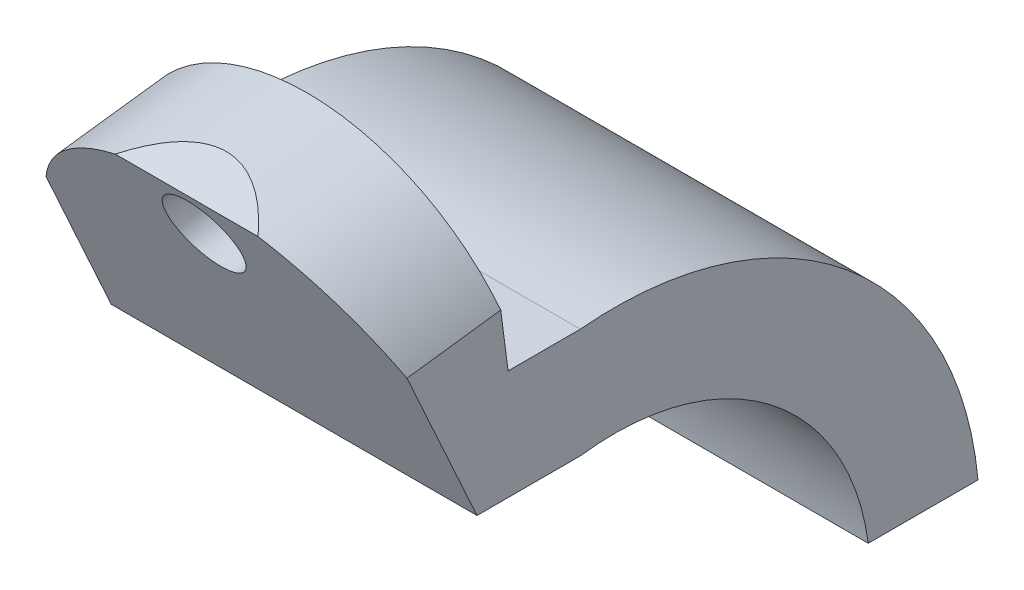
ISO-10303-21;
HEADER;
FILE_DESCRIPTION(('STEP AP214'),'2;1');
FILE_NAME('part.step','',(''),(''),'','','');
FILE_SCHEMA(('AUTOMOTIVE_DESIGN { 1 0 10303 214 1 1 1 1 }'));
ENDSEC;
DATA;
#1=APPLICATION_CONTEXT('core data for automotive mechanical design processes');
#2=APPLICATION_PROTOCOL_DEFINITION('international standard','automotive_design',2000,#1);
#3=PRODUCT_CONTEXT('',#1,'mechanical');
#4=PRODUCT('Part','Part','',(#3));
#5=PRODUCT_RELATED_PRODUCT_CATEGORY('part','',(#4));
#6=PRODUCT_DEFINITION_FORMATION('','',#4);
#7=PRODUCT_DEFINITION_CONTEXT('part definition',#1,'design');
#8=PRODUCT_DEFINITION('design','',#6,#7);
#9=PRODUCT_DEFINITION_SHAPE('','',#8);
#10=(LENGTH_UNIT() NAMED_UNIT(*) SI_UNIT(.MILLI.,.METRE.));
#11=(NAMED_UNIT(*) PLANE_ANGLE_UNIT() SI_UNIT($,.RADIAN.));
#12=(NAMED_UNIT(*) SI_UNIT($,.STERADIAN.) SOLID_ANGLE_UNIT());
#13=UNCERTAINTY_MEASURE_WITH_UNIT(LENGTH_MEASURE(1.E-05),#10,'distance_accuracy_value','');
#14=(GEOMETRIC_REPRESENTATION_CONTEXT(3) GLOBAL_UNCERTAINTY_ASSIGNED_CONTEXT((#13)) GLOBAL_UNIT_ASSIGNED_CONTEXT((#10,
#11,#12)) REPRESENTATION_CONTEXT('',''));
#15=CARTESIAN_POINT('',(0.,0.,0.));
#16=DIRECTION('',(0.,0.,1.));
#17=DIRECTION('',(1.,0.,0.));
#18=AXIS2_PLACEMENT_3D('',#15,#16,#17);
#19=CARTESIAN_POINT('',(100.,-29.7975521547871,69.3759802077101));
#20=DIRECTION('',(-1.,0.,0.));
#21=DIRECTION('',(0.,0.,1.));
#22=AXIS2_PLACEMENT_3D('',#19,#20,#21);
#23=CYLINDRICAL_SURFACE('',#22,70.);
#24=CARTESIAN_POINT('',(0.,-29.7975521547871,69.3759802077101));
#25=DIRECTION('',(-1.,0.,0.));
#26=DIRECTION('',(0.,0.,-1.));
#27=AXIS2_PLACEMENT_3D('',#24,#25,#26);
#28=CIRCLE('',#27,70.);
#29=CARTESIAN_POINT('',(0.,39.578428052923,78.7019316454676));
#30=VERTEX_POINT('',#29);
#31=CARTESIAN_POINT('',(0.,-20.4716007170291,0.));
#32=VERTEX_POINT('',#31);
#33=EDGE_CURVE('E225',#30,#32,#28,.T.);
#34=ORIENTED_EDGE('',*,*,#33,.T.);
#35=DIRECTION('',(-1.,0.,0.));
#36=VECTOR('',#35,1.);
#37=CARTESIAN_POINT('',(100.,-20.4716007170291,0.));
#38=LINE('',#37,#36);
#39=CARTESIAN_POINT('',(100.,-20.4716007170291,0.));
#40=VERTEX_POINT('',#39);
#41=EDGE_CURVE('E229',#40,#32,#38,.T.);
#42=ORIENTED_EDGE('',*,*,#41,.F.);
#43=CARTESIAN_POINT('',(100.,-29.7975521547871,69.3759802077101));
#44=DIRECTION('',(-1.,0.,0.));
#45=DIRECTION('',(0.,0.,-1.));
#46=AXIS2_PLACEMENT_3D('',#43,#44,#45);
#47=CIRCLE('',#46,70.);
#48=CARTESIAN_POINT('',(100.,39.578428052923,78.7019316454676));
#49=VERTEX_POINT('',#48);
#50=EDGE_CURVE('E127',#49,#40,#47,.T.);
#51=ORIENTED_EDGE('',*,*,#50,.F.);
#52=DIRECTION('',(-1.,0.,0.));
#53=VECTOR('',#52,1.);
#54=CARTESIAN_POINT('',(100.,39.578428052923,78.7019316454676));
#55=LINE('',#54,#53);
#56=EDGE_CURVE('E144',#49,#30,#55,.T.);
#57=ORIENTED_EDGE('',*,*,#56,.T.);
#58=EDGE_LOOP('',(#34,#42,#51,#57));
#59=FACE_BOUND('',#58,.T.);
#60=ADVANCED_FACE('F102',(#59),#23,.F.);
#61=CARTESIAN_POINT('',(100.,-20.4716007170291,0.));
#62=DIRECTION('',(0.,1.,0.));
#63=DIRECTION('',(0.,0.,1.));
#64=AXIS2_PLACEMENT_3D('',#61,#62,#63);
#65=PLANE('',#64);
#66=DIRECTION('',(0.,0.,-1.));
#67=VECTOR('',#66,1.);
#68=CARTESIAN_POINT('',(0.,-20.4716007170291,0.));
#69=LINE('',#68,#67);
#70=CARTESIAN_POINT('',(0.,-20.4716007170291,-30.));
#71=VERTEX_POINT('',#70);
#72=EDGE_CURVE('E222',#32,#71,#69,.T.);
#73=ORIENTED_EDGE('',*,*,#72,.T.);
#74=DIRECTION('',(-1.,0.,0.));
#75=VECTOR('',#74,1.);
#76=CARTESIAN_POINT('',(100.,-20.4716007170291,-30.));
#77=LINE('',#76,#75);
#78=CARTESIAN_POINT('',(100.,-20.4716007170291,-30.));
#79=VERTEX_POINT('',#78);
#80=EDGE_CURVE('E226',#79,#71,#77,.T.);
#81=ORIENTED_EDGE('',*,*,#80,.F.);
#82=DIRECTION('',(0.,0.,-1.));
#83=VECTOR('',#82,1.);
#84=CARTESIAN_POINT('',(100.,-20.4716007170291,0.));
#85=LINE('',#84,#83);
#86=EDGE_CURVE('E152',#40,#79,#85,.T.);
#87=ORIENTED_EDGE('',*,*,#86,.F.);
#88=ORIENTED_EDGE('',*,*,#41,.T.);
#89=EDGE_LOOP('',(#73,#81,#87,#88));
#90=FACE_BOUND('',#89,.T.);
#91=ADVANCED_FACE('F303',(#90),#65,.F.);
#92=CARTESIAN_POINT('',(100.,-29.797552154787,69.37598020771));
#93=DIRECTION('',(-1.,0.,0.));
#94=DIRECTION('',(0.,0.,1.));
#95=AXIS2_PLACEMENT_3D('',#92,#93,#94);
#96=CYLINDRICAL_SURFACE('',#95,99.8126185031862);
#97=CARTESIAN_POINT('',(0.,-29.797552154787,69.37598020771));
#98=DIRECTION('',(1.,0.,0.));
#99=DIRECTION('',(0.,0.,-1.));
#100=AXIS2_PLACEMENT_3D('',#97,#98,#99);
#101=CIRCLE('',#100,99.8126185031862);
#102=CARTESIAN_POINT('',(0.,69.578428052923,78.7019316454676));
#103=VERTEX_POINT('',#102);
#104=EDGE_CURVE('E224',#71,#103,#101,.T.);
#105=ORIENTED_EDGE('',*,*,#104,.T.);
#106=DIRECTION('',(-1.,0.,0.));
#107=VECTOR('',#106,1.);
#108=CARTESIAN_POINT('',(100.,69.578428052923,78.7019316454676));
#109=LINE('',#108,#107);
#110=CARTESIAN_POINT('',(100.,69.578428052923,78.7019316454676));
#111=VERTEX_POINT('',#110);
#112=EDGE_CURVE('E230',#111,#103,#109,.T.);
#113=ORIENTED_EDGE('',*,*,#112,.F.);
#114=CARTESIAN_POINT('',(100.,-29.797552154787,69.37598020771));
#115=DIRECTION('',(1.,0.,0.));
#116=DIRECTION('',(0.,0.,-1.));
#117=AXIS2_PLACEMENT_3D('',#114,#115,#116);
#118=CIRCLE('',#117,99.8126185031862);
#119=EDGE_CURVE('E221',#79,#111,#118,.T.);
#120=ORIENTED_EDGE('',*,*,#119,.F.);
#121=ORIENTED_EDGE('',*,*,#80,.T.);
#122=EDGE_LOOP('',(#105,#113,#120,#121));
#123=FACE_BOUND('',#122,.T.);
#124=ADVANCED_FACE('F307',(#123),#96,.T.);
#125=CARTESIAN_POINT('',(100.,-29.7975521547871,69.3759802077101));
#126=DIRECTION('',(1.,0.,0.));
#127=DIRECTION('',(0.,0.,-1.));
#128=AXIS2_PLACEMENT_3D('',#125,#126,#127);
#129=PLANE('',#128);
#130=DIRECTION('',(0.,0.129190599003945,-0.991619780525279));
#131=VECTOR('',#130,1.);
#132=CARTESIAN_POINT('',(100.,72.07059214012,199.630057632497));
#133=LINE('',#132,#131);
#134=CARTESIAN_POINT('',(100.,81.6508005775103,126.095882070842));
#135=VERTEX_POINT('',#134);
#136=CARTESIAN_POINT('',(100.,84.9896520405145,100.468079579969));
#137=VERTEX_POINT('',#136);
#138=EDGE_CURVE('E187',#135,#137,#133,.T.);
#139=ORIENTED_EDGE('',*,*,#138,.F.);
#140=DIRECTION('',(0.,0.910149174597233,0.414280677777731));
#141=VECTOR('',#140,1.);
#142=CARTESIAN_POINT('',(100.,39.578428052923,106.945426857919));
#143=LINE('',#142,#141);
#144=CARTESIAN_POINT('',(100.,39.578428052923,106.945426857919));
#145=VERTEX_POINT('',#144);
#146=EDGE_CURVE('E264',#145,#135,#143,.T.);
#147=ORIENTED_EDGE('',*,*,#146,.F.);
#148=DIRECTION('',(0.,0.,1.));
#149=VECTOR('',#148,1.);
#150=CARTESIAN_POINT('',(100.,39.578428052923,78.7019316454676));
#151=LINE('',#150,#149);
#152=EDGE_CURVE('E249',#49,#145,#151,.T.);
#153=ORIENTED_EDGE('',*,*,#152,.F.);
#154=ORIENTED_EDGE('',*,*,#50,.T.);
#155=ORIENTED_EDGE('',*,*,#86,.T.);
#156=ORIENTED_EDGE('',*,*,#119,.T.);
#157=DIRECTION('',(0.,0.,-1.));
#158=VECTOR('',#157,1.);
#159=CARTESIAN_POINT('',(100.,69.578428052923,78.7019316454676));
#160=LINE('',#159,#158);
#161=CARTESIAN_POINT('',(100.,69.578428052923,98.460268423473));
#162=VERTEX_POINT('',#161);
#163=EDGE_CURVE('E206',#162,#111,#160,.T.);
#164=ORIENTED_EDGE('',*,*,#163,.F.);
#165=DIRECTION('',(0.,-0.991619780525279,-0.129190599003945));
#166=VECTOR('',#165,1.);
#167=CARTESIAN_POINT('',(100.,120.447700010412,105.087638958177));
#168=LINE('',#167,#166);
#169=EDGE_CURVE('E105',#137,#162,#168,.T.);
#170=ORIENTED_EDGE('',*,*,#169,.F.);
#171=EDGE_LOOP('',(#139,#147,#153,#154,#155,#156,#164,#170));
#172=FACE_BOUND('',#171,.T.);
#173=ADVANCED_FACE('F318',(#172),#129,.T.);
#174=CARTESIAN_POINT('',(0.,-29.7975521547871,69.3759802077101));
#175=DIRECTION('',(1.,0.,0.));
#176=DIRECTION('',(0.,0.,-1.));
#177=AXIS2_PLACEMENT_3D('',#174,#175,#176);
#178=PLANE('',#177);
#179=DIRECTION('',(0.,0.910149174597233,0.414280677777731));
#180=VECTOR('',#179,1.);
#181=CARTESIAN_POINT('',(0.,51.9105839728411,112.558763721324));
#182=LINE('',#181,#180);
#183=CARTESIAN_POINT('',(0.,39.578428052923,106.945426857919));
#184=VERTEX_POINT('',#183);
#185=CARTESIAN_POINT('',(0.,78.7490179044931,124.775051896961));
#186=VERTEX_POINT('',#185);
#187=EDGE_CURVE('E199',#184,#186,#182,.T.);
#188=ORIENTED_EDGE('',*,*,#187,.T.);
#189=DIRECTION('',(0.,0.129190599003945,-0.991619780525279));
#190=VECTOR('',#189,1.);
#191=CARTESIAN_POINT('',(0.,69.0480319814124,199.236271258831));
#192=LINE('',#191,#190);
#193=CARTESIAN_POINT('',(0.,81.9670918818069,100.074293206303));
#194=VERTEX_POINT('',#193);
#195=EDGE_CURVE('E184',#186,#194,#192,.T.);
#196=ORIENTED_EDGE('',*,*,#195,.T.);
#197=DIRECTION('',(0.,-0.991619780525279,-0.129190599003945));
#198=VECTOR('',#197,1.);
#199=CARTESIAN_POINT('',(0.,120.447700010412,105.087638958177));
#200=LINE('',#199,#198);
#201=CARTESIAN_POINT('',(0.,69.578428052923,98.460268423473));
#202=VERTEX_POINT('',#201);
#203=EDGE_CURVE('E196',#194,#202,#200,.T.);
#204=ORIENTED_EDGE('',*,*,#203,.T.);
#205=DIRECTION('',(0.,0.,-1.));
#206=VECTOR('',#205,1.);
#207=CARTESIAN_POINT('',(0.,69.578428052923,78.7019316454676));
#208=LINE('',#207,#206);
#209=EDGE_CURVE('E217',#202,#103,#208,.T.);
#210=ORIENTED_EDGE('',*,*,#209,.T.);
#211=ORIENTED_EDGE('',*,*,#104,.F.);
#212=ORIENTED_EDGE('',*,*,#72,.F.);
#213=ORIENTED_EDGE('',*,*,#33,.F.);
#214=DIRECTION('',(0.,0.,1.));
#215=VECTOR('',#214,1.);
#216=CARTESIAN_POINT('',(0.,39.578428052923,94.8854186649868));
#217=LINE('',#216,#215);
#218=EDGE_CURVE('E267',#30,#184,#217,.T.);
#219=ORIENTED_EDGE('',*,*,#218,.T.);
#220=EDGE_LOOP('',(#188,#196,#204,#210,#211,#212,#213,#219));
#221=FACE_BOUND('',#220,.T.);
#222=ADVANCED_FACE('F194',(#221),#178,.F.);
#223=CARTESIAN_POINT('',(100.,69.578428052923,78.7019316454676));
#224=DIRECTION('',(0.,1.,0.));
#225=DIRECTION('',(0.,0.,1.));
#226=AXIS2_PLACEMENT_3D('',#223,#224,#225);
#227=PLANE('',#226);
#228=ORIENTED_EDGE('',*,*,#209,.F.);
#229=DIRECTION('',(-1.,0.,0.));
#230=VECTOR('',#229,1.);
#231=CARTESIAN_POINT('',(100.,69.578428052923,98.460268423473));
#232=LINE('',#231,#230);
#233=EDGE_CURVE('E204',#162,#202,#232,.T.);
#234=ORIENTED_EDGE('',*,*,#233,.F.);
#235=ORIENTED_EDGE('',*,*,#163,.T.);
#236=ORIENTED_EDGE('',*,*,#112,.T.);
#237=EDGE_LOOP('',(#228,#234,#235,#236));
#238=FACE_BOUND('',#237,.T.);
#239=ADVANCED_FACE('F291',(#238),#227,.T.);
#240=CARTESIAN_POINT('',(100.,120.447700010412,105.087638958177));
#241=DIRECTION('',(0.,0.129190599003945,-0.991619780525279));
#242=DIRECTION('',(0.,0.991619780525279,0.129190599003945));
#243=AXIS2_PLACEMENT_3D('',#240,#241,#242);
#244=PLANE('',#243);
#245=CARTESIAN_POINT('',(50.7882486217323,57.834793493952,96.9302795981662));
#246=DIRECTION('',(0.,-0.129190599003945,0.991619780525279));
#247=DIRECTION('',(0.,-0.991619780525279,-0.129190599003945));
#248=AXIS2_PLACEMENT_3D('',#245,#246,#247);
#249=CIRCLE('',#248,56.3178377169392);
#250=EDGE_CURVE('E181',#137,#194,#249,.T.);
#251=ORIENTED_EDGE('',*,*,#250,.F.);
#252=ORIENTED_EDGE('',*,*,#169,.T.);
#253=ORIENTED_EDGE('',*,*,#233,.T.);
#254=ORIENTED_EDGE('',*,*,#203,.F.);
#255=EDGE_LOOP('',(#251,#252,#253,#254));
#256=FACE_BOUND('',#255,.T.);
#257=CARTESIAN_POINT('',(50.,97.4577126951532,102.092448371339));
#258=DIRECTION('',(0.,0.129190599003945,-0.991619780525279));
#259=DIRECTION('',(0.,0.991619780525279,0.129190599003945));
#260=AXIS2_PLACEMENT_3D('',#257,#258,#259);
#261=CIRCLE('',#260,10.5382986649673);
#262=CARTESIAN_POINT('',(50.,107.907698104418,103.453897488349));
#263=VERTEX_POINT('',#262);
#264=EDGE_CURVE('E254',#263,#263,#261,.T.);
#265=ORIENTED_EDGE('',*,*,#264,.F.);
#266=EDGE_LOOP('',(#265));
#267=FACE_BOUND('',#266,.T.);
#268=ADVANCED_FACE('F201',(#256,#267),#244,.T.);
#269=CARTESIAN_POINT('',(100.,105.867737452136,137.118920164087));
#270=DIRECTION('',(0.,0.910149174597232,0.414280677777731));
#271=DIRECTION('',(0.,-0.414280677777731,0.910149174597233));
#272=AXIS2_PLACEMENT_3D('',#269,#270,#271);
#273=PLANE('',#272);
#274=CARTESIAN_POINT('',(50.7882486217323,31.2383053926241,301.075193369924));
#275=DIRECTION('',(0.,0.910149174597232,0.414280677777731));
#276=DIRECTION('',(0.,0.414280677777731,-0.910149174597233));
#277=AXIS2_PLACEMENT_3D('',#274,#275,#276);
#278=ELLIPSE('',#277,192.062776634381,56.3178377169392);
#279=CARTESIAN_POINT('',(31.2564374704917,105.867737452136,137.118920164087));
#280=VERTEX_POINT('',#279);
#281=CARTESIAN_POINT('',(70.3200597729728,105.867737452136,137.118920164087));
#282=VERTEX_POINT('',#281);
#283=EDGE_CURVE('E118',#280,#282,#278,.F.);
#284=ORIENTED_EDGE('',*,*,#283,.F.);
#285=DIRECTION('',(-1.,0.,0.));
#286=VECTOR('',#285,1.);
#287=CARTESIAN_POINT('',(100.,105.867737452136,137.118920164087));
#288=LINE('',#287,#286);
#289=EDGE_CURVE('E207',#282,#280,#288,.T.);
#290=ORIENTED_EDGE('',*,*,#289,.F.);
#291=EDGE_LOOP('',(#284,#290));
#292=FACE_BOUND('',#291,.T.);
#293=ADVANCED_FACE('F290',(#292),#273,.T.);
#294=CARTESIAN_POINT('',(100.,51.9105839728411,112.558763721324));
#295=DIRECTION('',(0.,-0.414280677777731,0.910149174597232));
#296=DIRECTION('',(0.,-0.910149174597233,-0.414280677777731));
#297=AXIS2_PLACEMENT_3D('',#294,#295,#296);
#298=PLANE('',#297);
#299=CARTESIAN_POINT('',(50.7882486217323,55.5810140782594,114.229465969098));
#300=DIRECTION('',(0.,-0.414280677777731,0.910149174597232));
#301=DIRECTION('',(0.,-0.910149174597233,-0.414280677777731));
#302=AXIS2_PLACEMENT_3D('',#299,#300,#301);
#303=ELLIPSE('',#302,58.9072167242205,56.3178377169392);
#304=EDGE_CURVE('E12',#186,#280,#303,.F.);
#305=ORIENTED_EDGE('',*,*,#304,.F.);
#306=ORIENTED_EDGE('',*,*,#187,.F.);
#307=DIRECTION('',(-1.,0.,0.));
#308=VECTOR('',#307,1.);
#309=CARTESIAN_POINT('',(100.,39.578428052923,106.945426857919));
#310=LINE('',#309,#308);
#311=EDGE_CURVE('E261',#145,#184,#310,.T.);
#312=ORIENTED_EDGE('',*,*,#311,.F.);
#313=ORIENTED_EDGE('',*,*,#146,.T.);
#314=EDGE_CURVE('E111',#282,#135,#303,.F.);
#315=ORIENTED_EDGE('',*,*,#314,.F.);
#316=ORIENTED_EDGE('',*,*,#289,.T.);
#317=EDGE_LOOP('',(#305,#306,#312,#313,#315,#316));
#318=FACE_BOUND('',#317,.T.);
#319=CARTESIAN_POINT('',(50.,93.6206541036775,131.54430653809));
#320=DIRECTION('',(0.,-0.414280677777731,0.910149174597232));
#321=DIRECTION('',(0.,-0.910149174597233,-0.414280677777731));
#322=AXIS2_PLACEMENT_3D('',#319,#320,#321);
#323=ELLIPSE('',#322,11.022828086581,10.5382986649673);
#324=CARTESIAN_POINT('',(50.,83.5882362189485,126.977761847354));
#325=VERTEX_POINT('',#324);
#326=EDGE_CURVE('E252',#325,#325,#323,.T.);
#327=ORIENTED_EDGE('',*,*,#326,.F.);
#328=EDGE_LOOP('',(#327));
#329=FACE_BOUND('',#328,.T.);
#330=ADVANCED_FACE('F297',(#318,#329),#298,.T.);
#331=CARTESIAN_POINT('',(100.,39.578428052923,94.8854186649868));
#332=DIRECTION('',(0.,-1.,0.));
#333=DIRECTION('',(0.,0.,-1.));
#334=AXIS2_PLACEMENT_3D('',#331,#332,#333);
#335=PLANE('',#334);
#336=ORIENTED_EDGE('',*,*,#218,.F.);
#337=ORIENTED_EDGE('',*,*,#56,.F.);
#338=ORIENTED_EDGE('',*,*,#152,.T.);
#339=ORIENTED_EDGE('',*,*,#311,.T.);
#340=EDGE_LOOP('',(#336,#337,#338,#339));
#341=FACE_BOUND('',#340,.T.);
#342=ADVANCED_FACE('F311',(#341),#335,.T.);
#343=CARTESIAN_POINT('',(50.,84.5386527947587,201.254426423867));
#344=DIRECTION('',(0.,0.129190599003945,-0.991619780525279));
#345=DIRECTION('',(0.,0.991619780525279,0.129190599003945));
#346=AXIS2_PLACEMENT_3D('',#343,#344,#345);
#347=CYLINDRICAL_SURFACE('',#346,10.5382986649673);
#348=ORIENTED_EDGE('',*,*,#326,.T.);
#349=EDGE_LOOP('',(#348));
#350=FACE_BOUND('',#349,.T.);
#351=ORIENTED_EDGE('',*,*,#264,.T.);
#352=EDGE_LOOP('',(#351));
#353=FACE_BOUND('',#352,.T.);
#354=ADVANCED_FACE('F288',(#350,#353),#347,.F.);
#355=CARTESIAN_POINT('',(50.7882486217323,44.9157335935575,196.092257650694));
#356=DIRECTION('',(0.,0.129190599003945,-0.991619780525279));
#357=DIRECTION('',(0.,0.991619780525279,0.129190599003945));
#358=AXIS2_PLACEMENT_3D('',#355,#356,#357);
#359=CYLINDRICAL_SURFACE('',#358,56.3178377169392);
#360=ORIENTED_EDGE('',*,*,#304,.T.);
#361=ORIENTED_EDGE('',*,*,#283,.T.);
#362=ORIENTED_EDGE('',*,*,#314,.T.);
#363=ORIENTED_EDGE('',*,*,#138,.T.);
#364=ORIENTED_EDGE('',*,*,#250,.T.);
#365=ORIENTED_EDGE('',*,*,#195,.F.);
#366=EDGE_LOOP('',(#360,#361,#362,#363,#364,#365));
#367=FACE_BOUND('',#366,.T.);
#368=ADVANCED_FACE('F183',(#367),#359,.T.);
#369=CLOSED_SHELL('',(#60,#91,#124,#173,#222,#239,#268,#293,#330,#342,#354,#368));
#370=MANIFOLD_SOLID_BREP('B2',#369);
#371=ADVANCED_BREP_SHAPE_REPRESENTATION('',(#18,#370),#14);
#372=SHAPE_DEFINITION_REPRESENTATION(#9,#371);
ENDSEC;
END-ISO-10303-21;
